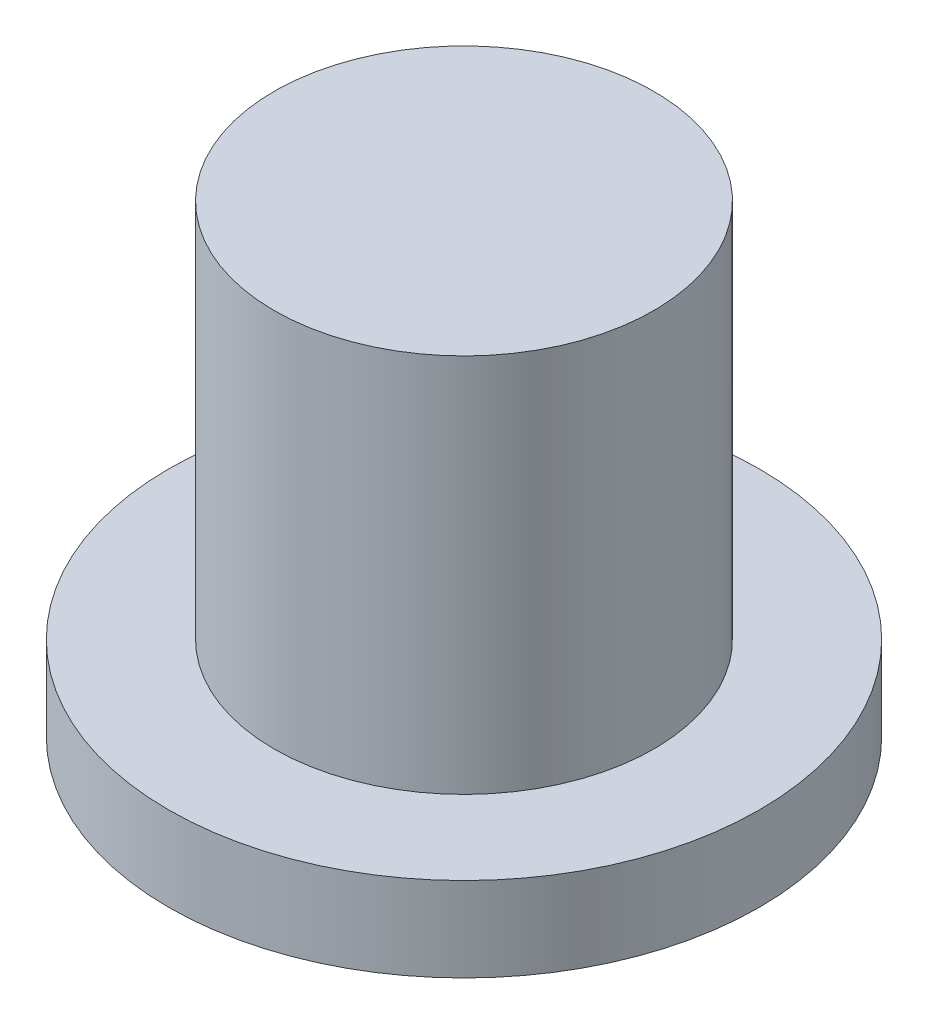
ISO-10303-21;
HEADER;
FILE_DESCRIPTION(('STEP AP214'),'2;1');
FILE_NAME('part.step','',(''),(''),'','','');
FILE_SCHEMA(('AUTOMOTIVE_DESIGN { 1 0 10303 214 1 1 1 1 }'));
ENDSEC;
DATA;
#1=APPLICATION_CONTEXT('core data for automotive mechanical design processes');
#2=APPLICATION_PROTOCOL_DEFINITION('international standard','automotive_design',2000,#1);
#3=PRODUCT_CONTEXT('',#1,'mechanical');
#4=PRODUCT('Part','Part','',(#3));
#5=PRODUCT_RELATED_PRODUCT_CATEGORY('part','',(#4));
#6=PRODUCT_DEFINITION_FORMATION('','',#4);
#7=PRODUCT_DEFINITION_CONTEXT('part definition',#1,'design');
#8=PRODUCT_DEFINITION('design','',#6,#7);
#9=PRODUCT_DEFINITION_SHAPE('','',#8);
#10=(LENGTH_UNIT() NAMED_UNIT(*) SI_UNIT(.MILLI.,.METRE.));
#11=(NAMED_UNIT(*) PLANE_ANGLE_UNIT() SI_UNIT($,.RADIAN.));
#12=(NAMED_UNIT(*) SI_UNIT($,.STERADIAN.) SOLID_ANGLE_UNIT());
#13=UNCERTAINTY_MEASURE_WITH_UNIT(LENGTH_MEASURE(1.E-05),#10,'distance_accuracy_value','');
#14=(GEOMETRIC_REPRESENTATION_CONTEXT(3) GLOBAL_UNCERTAINTY_ASSIGNED_CONTEXT((#13)) GLOBAL_UNIT_ASSIGNED_CONTEXT((#10,
#11,#12)) REPRESENTATION_CONTEXT('',''));
#15=CARTESIAN_POINT('',(0.,0.,0.));
#16=DIRECTION('',(0.,0.,1.));
#17=DIRECTION('',(1.,0.,0.));
#18=AXIS2_PLACEMENT_3D('',#15,#16,#17);
#19=CARTESIAN_POINT('',(0.,1.,0.));
#20=DIRECTION('',(0.,-1.,0.));
#21=DIRECTION('',(0.,0.,-1.));
#22=AXIS2_PLACEMENT_3D('',#19,#20,#21);
#23=CYLINDRICAL_SURFACE('',#22,3.5);
#24=CARTESIAN_POINT('',(0.,1.,0.));
#25=DIRECTION('',(0.,1.,0.));
#26=DIRECTION('',(0.,0.,1.));
#27=AXIS2_PLACEMENT_3D('',#24,#25,#26);
#28=CIRCLE('',#27,3.5);
#29=CARTESIAN_POINT('',(0.,1.,3.5));
#30=VERTEX_POINT('',#29);
#31=EDGE_CURVE('E40',#30,#30,#28,.T.);
#32=ORIENTED_EDGE('',*,*,#31,.F.);
#33=EDGE_LOOP('',(#32));
#34=FACE_BOUND('',#33,.T.);
#35=CARTESIAN_POINT('',(0.,0.,0.));
#36=DIRECTION('',(0.,1.,0.));
#37=DIRECTION('',(0.,0.,1.));
#38=AXIS2_PLACEMENT_3D('',#35,#36,#37);
#39=CIRCLE('',#38,3.5);
#40=CARTESIAN_POINT('',(0.,0.,3.5));
#41=VERTEX_POINT('',#40);
#42=EDGE_CURVE('E36',#41,#41,#39,.T.);
#43=ORIENTED_EDGE('',*,*,#42,.T.);
#44=EDGE_LOOP('',(#43));
#45=FACE_BOUND('',#44,.T.);
#46=ADVANCED_FACE('F33',(#34,#45),#23,.T.);
#47=CARTESIAN_POINT('',(0.,1.,0.));
#48=DIRECTION('',(0.,1.,0.));
#49=DIRECTION('',(0.,0.,1.));
#50=AXIS2_PLACEMENT_3D('',#47,#48,#49);
#51=PLANE('',#50);
#52=CARTESIAN_POINT('',(0.,1.,0.));
#53=DIRECTION('',(0.,1.,0.));
#54=DIRECTION('',(0.,0.,1.));
#55=AXIS2_PLACEMENT_3D('',#52,#53,#54);
#56=CIRCLE('',#55,2.25);
#57=CARTESIAN_POINT('',(0.,1.,2.25));
#58=VERTEX_POINT('',#57);
#59=EDGE_CURVE('E10',#58,#58,#56,.T.);
#60=ORIENTED_EDGE('',*,*,#59,.F.);
#61=EDGE_LOOP('',(#60));
#62=FACE_BOUND('',#61,.T.);
#63=ORIENTED_EDGE('',*,*,#31,.T.);
#64=EDGE_LOOP('',(#63));
#65=FACE_BOUND('',#64,.T.);
#66=ADVANCED_FACE('F57',(#62,#65),#51,.T.);
#67=CARTESIAN_POINT('',(0.,0.,0.));
#68=DIRECTION('',(0.,1.,0.));
#69=DIRECTION('',(0.,0.,1.));
#70=AXIS2_PLACEMENT_3D('',#67,#68,#69);
#71=PLANE('',#70);
#72=ORIENTED_EDGE('',*,*,#42,.F.);
#73=EDGE_LOOP('',(#72));
#74=FACE_BOUND('',#73,.T.);
#75=ADVANCED_FACE('F54',(#74),#71,.F.);
#76=CARTESIAN_POINT('',(0.,5.5,0.));
#77=DIRECTION('',(0.,-1.,0.));
#78=DIRECTION('',(0.,0.,-1.));
#79=AXIS2_PLACEMENT_3D('',#76,#77,#78);
#80=CYLINDRICAL_SURFACE('',#79,2.25);
#81=CARTESIAN_POINT('',(0.,5.5,0.));
#82=DIRECTION('',(0.,1.,0.));
#83=DIRECTION('',(0.,0.,1.));
#84=AXIS2_PLACEMENT_3D('',#81,#82,#83);
#85=CIRCLE('',#84,2.25);
#86=CARTESIAN_POINT('',(0.,5.5,2.25));
#87=VERTEX_POINT('',#86);
#88=EDGE_CURVE('E46',#87,#87,#85,.T.);
#89=ORIENTED_EDGE('',*,*,#88,.F.);
#90=EDGE_LOOP('',(#89));
#91=FACE_BOUND('',#90,.T.);
#92=ORIENTED_EDGE('',*,*,#59,.T.);
#93=EDGE_LOOP('',(#92));
#94=FACE_BOUND('',#93,.T.);
#95=ADVANCED_FACE('F56',(#91,#94),#80,.T.);
#96=CARTESIAN_POINT('',(0.,5.5,0.));
#97=DIRECTION('',(0.,1.,0.));
#98=DIRECTION('',(0.,0.,1.));
#99=AXIS2_PLACEMENT_3D('',#96,#97,#98);
#100=PLANE('',#99);
#101=ORIENTED_EDGE('',*,*,#88,.T.);
#102=EDGE_LOOP('',(#101));
#103=FACE_BOUND('',#102,.T.);
#104=ADVANCED_FACE('F62',(#103),#100,.T.);
#105=CLOSED_SHELL('',(#46,#66,#75,#95,#104));
#106=MANIFOLD_SOLID_BREP('B2',#105);
#107=ADVANCED_BREP_SHAPE_REPRESENTATION('',(#18,#106),#14);
#108=SHAPE_DEFINITION_REPRESENTATION(#9,#107);
ENDSEC;
END-ISO-10303-21;
